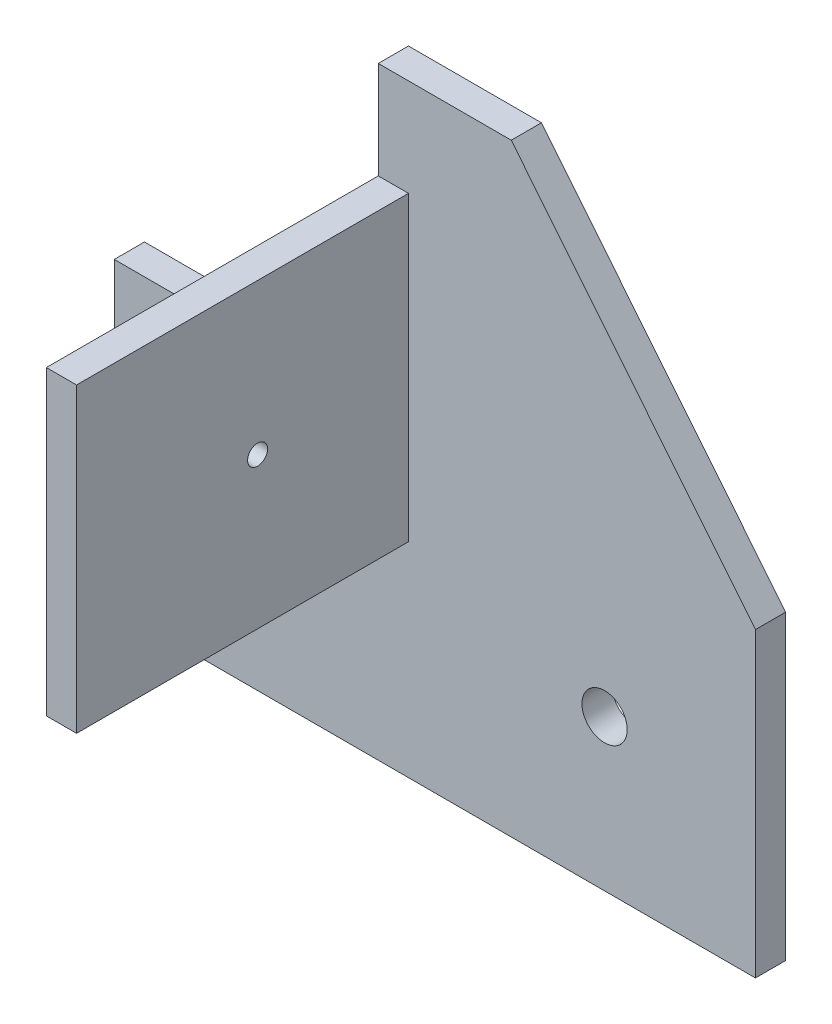
ISO-10303-21;
HEADER;
FILE_DESCRIPTION(('STEP AP214'),'2;1');
FILE_NAME('part.step','',(''),(''),'','','');
FILE_SCHEMA(('AUTOMOTIVE_DESIGN { 1 0 10303 214 1 1 1 1 }'));
ENDSEC;
DATA;
#1=APPLICATION_CONTEXT('core data for automotive mechanical design processes');
#2=APPLICATION_PROTOCOL_DEFINITION('international standard','automotive_design',2000,#1);
#3=PRODUCT_CONTEXT('',#1,'mechanical');
#4=PRODUCT('Part','Part','',(#3));
#5=PRODUCT_RELATED_PRODUCT_CATEGORY('part','',(#4));
#6=PRODUCT_DEFINITION_FORMATION('','',#4);
#7=PRODUCT_DEFINITION_CONTEXT('part definition',#1,'design');
#8=PRODUCT_DEFINITION('design','',#6,#7);
#9=PRODUCT_DEFINITION_SHAPE('','',#8);
#10=(LENGTH_UNIT() NAMED_UNIT(*) SI_UNIT(.MILLI.,.METRE.));
#11=(NAMED_UNIT(*) PLANE_ANGLE_UNIT() SI_UNIT($,.RADIAN.));
#12=(NAMED_UNIT(*) SI_UNIT($,.STERADIAN.) SOLID_ANGLE_UNIT());
#13=UNCERTAINTY_MEASURE_WITH_UNIT(LENGTH_MEASURE(1.E-05),#10,'distance_accuracy_value','');
#14=(GEOMETRIC_REPRESENTATION_CONTEXT(3) GLOBAL_UNCERTAINTY_ASSIGNED_CONTEXT((#13)) GLOBAL_UNIT_ASSIGNED_CONTEXT((#10,
#11,#12)) REPRESENTATION_CONTEXT('',''));
#15=CARTESIAN_POINT('',(0.,0.,0.));
#16=DIRECTION('',(0.,0.,1.));
#17=DIRECTION('',(1.,0.,0.));
#18=AXIS2_PLACEMENT_3D('',#15,#16,#17);
#19=CARTESIAN_POINT('',(0.,0.,4.));
#20=DIRECTION('',(0.,0.,-1.));
#21=DIRECTION('',(-1.,0.,0.));
#22=AXIS2_PLACEMENT_3D('',#19,#20,#21);
#23=PLANE('',#22);
#24=DIRECTION('',(0.,-1.,0.));
#25=VECTOR('',#24,1.);
#26=CARTESIAN_POINT('',(-43.1322957198443,0.,4.));
#27=LINE('',#26,#25);
#28=CARTESIAN_POINT('',(-43.1322957198443,40.,4.));
#29=VERTEX_POINT('',#28);
#30=CARTESIAN_POINT('',(-43.1322957198443,27.0855842893383,4.));
#31=VERTEX_POINT('',#30);
#32=EDGE_CURVE('E175',#29,#31,#27,.T.);
#33=ORIENTED_EDGE('',*,*,#32,.T.);
#34=DIRECTION('',(1.,0.,0.));
#35=VECTOR('',#34,1.);
#36=CARTESIAN_POINT('',(0.,27.0855842893383,4.));
#37=LINE('',#36,#35);
#38=CARTESIAN_POINT('',(-39.1322957198443,27.0855842893383,4.));
#39=VERTEX_POINT('',#38);
#40=EDGE_CURVE('E50',#31,#39,#37,.T.);
#41=ORIENTED_EDGE('',*,*,#40,.T.);
#42=DIRECTION('',(0.,1.,0.));
#43=VECTOR('',#42,1.);
#44=CARTESIAN_POINT('',(-39.1322957198443,0.,4.));
#45=LINE('',#44,#43);
#46=CARTESIAN_POINT('',(-39.1322957198443,-12.9144157106617,4.));
#47=VERTEX_POINT('',#46);
#48=EDGE_CURVE('E54',#47,#39,#45,.T.);
#49=ORIENTED_EDGE('',*,*,#48,.F.);
#50=DIRECTION('',(-1.,0.,0.));
#51=VECTOR('',#50,1.);
#52=CARTESIAN_POINT('',(0.,-12.9144157106617,4.));
#53=LINE('',#52,#51);
#54=CARTESIAN_POINT('',(-43.1322957198443,-12.9144157106617,4.));
#55=VERTEX_POINT('',#54);
#56=EDGE_CURVE('E122',#47,#55,#53,.T.);
#57=ORIENTED_EDGE('',*,*,#56,.T.);
#58=DIRECTION('',(0.,1.,0.));
#59=VECTOR('',#58,1.);
#60=CARTESIAN_POINT('',(-43.1322957198443,0.,4.));
#61=LINE('',#60,#59);
#62=CARTESIAN_POINT('',(-43.1322957198443,0.,4.));
#63=VERTEX_POINT('',#62);
#64=EDGE_CURVE('E149',#55,#63,#61,.T.);
#65=ORIENTED_EDGE('',*,*,#64,.T.);
#66=DIRECTION('',(-1.,0.,0.));
#67=VECTOR('',#66,1.);
#68=CARTESIAN_POINT('',(-78.1322957198443,0.,4.));
#69=LINE('',#68,#67);
#70=CARTESIAN_POINT('',(-78.1322957198443,0.,4.));
#71=VERTEX_POINT('',#70);
#72=EDGE_CURVE('E177',#63,#71,#69,.T.);
#73=ORIENTED_EDGE('',*,*,#72,.T.);
#74=DIRECTION('',(0.,-1.,0.));
#75=VECTOR('',#74,1.);
#76=CARTESIAN_POINT('',(-78.1322957198443,-40.,4.));
#77=LINE('',#76,#75);
#78=CARTESIAN_POINT('',(-78.1322957198443,-40.,4.));
#79=VERTEX_POINT('',#78);
#80=EDGE_CURVE('E163',#71,#79,#77,.T.);
#81=ORIENTED_EDGE('',*,*,#80,.T.);
#82=DIRECTION('',(1.,0.,0.));
#83=VECTOR('',#82,1.);
#84=CARTESIAN_POINT('',(6.86770428015567,-40.,4.));
#85=LINE('',#84,#83);
#86=CARTESIAN_POINT('',(6.86770428015567,-40.,4.));
#87=VERTEX_POINT('',#86);
#88=EDGE_CURVE('E166',#79,#87,#85,.T.);
#89=ORIENTED_EDGE('',*,*,#88,.T.);
#90=DIRECTION('',(0.,1.,0.));
#91=VECTOR('',#90,1.);
#92=CARTESIAN_POINT('',(6.86770428015566,0.,4.));
#93=LINE('',#92,#91);
#94=CARTESIAN_POINT('',(6.86770428015566,0.,4.));
#95=VERTEX_POINT('',#94);
#96=EDGE_CURVE('E169',#87,#95,#93,.T.);
#97=ORIENTED_EDGE('',*,*,#96,.T.);
#98=DIRECTION('',(-0.629111216456673,0.777315301102716,0.));
#99=VECTOR('',#98,1.);
#100=CARTESIAN_POINT('',(-25.5058365758755,40.,4.));
#101=LINE('',#100,#99);
#102=CARTESIAN_POINT('',(-25.5058365758755,40.,4.));
#103=VERTEX_POINT('',#102);
#104=EDGE_CURVE('E171',#95,#103,#101,.T.);
#105=ORIENTED_EDGE('',*,*,#104,.T.);
#106=DIRECTION('',(-1.,0.,0.));
#107=VECTOR('',#106,1.);
#108=CARTESIAN_POINT('',(-43.1322957198443,40.,4.));
#109=LINE('',#108,#107);
#110=EDGE_CURVE('E173',#103,#29,#109,.T.);
#111=ORIENTED_EDGE('',*,*,#110,.T.);
#112=EDGE_LOOP('',(#33,#41,#49,#57,#65,#73,#81,#89,#97,#105,#111));
#113=FACE_BOUND('',#112,.T.);
#114=CARTESIAN_POINT('',(-13.1322957198443,-20.,4.));
#115=DIRECTION('',(0.,0.,1.));
#116=DIRECTION('',(1.,0.,0.));
#117=AXIS2_PLACEMENT_3D('',#114,#115,#116);
#118=CIRCLE('',#117,3.);
#119=CARTESIAN_POINT('',(-10.1322957198443,-20.,4.));
#120=VERTEX_POINT('',#119);
#121=EDGE_CURVE('E157',#120,#120,#118,.T.);
#122=ORIENTED_EDGE('',*,*,#121,.F.);
#123=EDGE_LOOP('',(#122));
#124=FACE_BOUND('',#123,.T.);
#125=ADVANCED_FACE('F35',(#113,#124),#23,.F.);
#126=CARTESIAN_POINT('',(0.,0.,0.));
#127=DIRECTION('',(0.,0.,-1.));
#128=DIRECTION('',(-1.,0.,0.));
#129=AXIS2_PLACEMENT_3D('',#126,#127,#128);
#130=PLANE('',#129);
#131=DIRECTION('',(-1.,0.,0.));
#132=VECTOR('',#131,1.);
#133=CARTESIAN_POINT('',(-78.1322957198443,0.,0.));
#134=LINE('',#133,#132);
#135=CARTESIAN_POINT('',(-43.1322957198443,0.,0.));
#136=VERTEX_POINT('',#135);
#137=CARTESIAN_POINT('',(-78.1322957198443,0.,0.));
#138=VERTEX_POINT('',#137);
#139=EDGE_CURVE('E167',#136,#138,#134,.T.);
#140=ORIENTED_EDGE('',*,*,#139,.F.);
#141=DIRECTION('',(0.,-1.,0.));
#142=VECTOR('',#141,1.);
#143=CARTESIAN_POINT('',(-43.1322957198443,0.,0.));
#144=LINE('',#143,#142);
#145=CARTESIAN_POINT('',(-43.1322957198443,40.,0.));
#146=VERTEX_POINT('',#145);
#147=EDGE_CURVE('E190',#146,#136,#144,.T.);
#148=ORIENTED_EDGE('',*,*,#147,.F.);
#149=DIRECTION('',(-1.,0.,0.));
#150=VECTOR('',#149,1.);
#151=CARTESIAN_POINT('',(-43.1322957198443,40.,0.));
#152=LINE('',#151,#150);
#153=CARTESIAN_POINT('',(-25.5058365758755,40.,0.));
#154=VERTEX_POINT('',#153);
#155=EDGE_CURVE('E188',#154,#146,#152,.T.);
#156=ORIENTED_EDGE('',*,*,#155,.F.);
#157=DIRECTION('',(-0.629111216456673,0.777315301102716,0.));
#158=VECTOR('',#157,1.);
#159=CARTESIAN_POINT('',(-25.5058365758755,40.,0.));
#160=LINE('',#159,#158);
#161=CARTESIAN_POINT('',(6.86770428015566,0.,0.));
#162=VERTEX_POINT('',#161);
#163=EDGE_CURVE('E186',#162,#154,#160,.T.);
#164=ORIENTED_EDGE('',*,*,#163,.F.);
#165=DIRECTION('',(0.,1.,0.));
#166=VECTOR('',#165,1.);
#167=CARTESIAN_POINT('',(6.86770428015566,0.,0.));
#168=LINE('',#167,#166);
#169=CARTESIAN_POINT('',(6.86770428015567,-40.,0.));
#170=VERTEX_POINT('',#169);
#171=EDGE_CURVE('E184',#170,#162,#168,.T.);
#172=ORIENTED_EDGE('',*,*,#171,.F.);
#173=DIRECTION('',(1.,0.,0.));
#174=VECTOR('',#173,1.);
#175=CARTESIAN_POINT('',(6.86770428015567,-40.,0.));
#176=LINE('',#175,#174);
#177=CARTESIAN_POINT('',(-78.1322957198443,-40.,0.));
#178=VERTEX_POINT('',#177);
#179=EDGE_CURVE('E182',#178,#170,#176,.T.);
#180=ORIENTED_EDGE('',*,*,#179,.F.);
#181=DIRECTION('',(0.,-1.,0.));
#182=VECTOR('',#181,1.);
#183=CARTESIAN_POINT('',(-78.1322957198443,-40.,0.));
#184=LINE('',#183,#182);
#185=EDGE_CURVE('E160',#138,#178,#184,.T.);
#186=ORIENTED_EDGE('',*,*,#185,.F.);
#187=EDGE_LOOP('',(#140,#148,#156,#164,#172,#180,#186));
#188=FACE_BOUND('',#187,.T.);
#189=CARTESIAN_POINT('',(-13.1322957198443,-20.,0.));
#190=DIRECTION('',(0.,0.,1.));
#191=DIRECTION('',(1.,0.,0.));
#192=AXIS2_PLACEMENT_3D('',#189,#190,#191);
#193=CIRCLE('',#192,3.);
#194=CARTESIAN_POINT('',(-10.1322957198443,-20.,0.));
#195=VERTEX_POINT('',#194);
#196=EDGE_CURVE('E156',#195,#195,#193,.T.);
#197=ORIENTED_EDGE('',*,*,#196,.T.);
#198=EDGE_LOOP('',(#197));
#199=FACE_BOUND('',#198,.T.);
#200=ADVANCED_FACE('F217',(#188,#199),#130,.T.);
#201=CARTESIAN_POINT('',(-78.1322957198443,-40.,4.));
#202=DIRECTION('',(1.,0.,0.));
#203=DIRECTION('',(0.,0.,-1.));
#204=AXIS2_PLACEMENT_3D('',#201,#202,#203);
#205=PLANE('',#204);
#206=ORIENTED_EDGE('',*,*,#185,.T.);
#207=DIRECTION('',(0.,0.,-1.));
#208=VECTOR('',#207,1.);
#209=CARTESIAN_POINT('',(-78.1322957198443,-40.,4.));
#210=LINE('',#209,#208);
#211=EDGE_CURVE('E11',#79,#178,#210,.T.);
#212=ORIENTED_EDGE('',*,*,#211,.F.);
#213=ORIENTED_EDGE('',*,*,#80,.F.);
#214=DIRECTION('',(0.,0.,-1.));
#215=VECTOR('',#214,1.);
#216=CARTESIAN_POINT('',(-78.1322957198443,0.,4.));
#217=LINE('',#216,#215);
#218=EDGE_CURVE('E179',#71,#138,#217,.T.);
#219=ORIENTED_EDGE('',*,*,#218,.T.);
#220=EDGE_LOOP('',(#206,#212,#213,#219));
#221=FACE_BOUND('',#220,.T.);
#222=ADVANCED_FACE('F37',(#221),#205,.F.);
#223=CARTESIAN_POINT('',(6.86770428015567,-40.,4.));
#224=DIRECTION('',(0.,1.,0.));
#225=DIRECTION('',(-1.,0.,0.));
#226=AXIS2_PLACEMENT_3D('',#223,#224,#225);
#227=PLANE('',#226);
#228=ORIENTED_EDGE('',*,*,#179,.T.);
#229=DIRECTION('',(0.,0.,-1.));
#230=VECTOR('',#229,1.);
#231=CARTESIAN_POINT('',(6.86770428015567,-40.,4.));
#232=LINE('',#231,#230);
#233=EDGE_CURVE('E43',#87,#170,#232,.T.);
#234=ORIENTED_EDGE('',*,*,#233,.F.);
#235=ORIENTED_EDGE('',*,*,#88,.F.);
#236=ORIENTED_EDGE('',*,*,#211,.T.);
#237=EDGE_LOOP('',(#228,#234,#235,#236));
#238=FACE_BOUND('',#237,.T.);
#239=ADVANCED_FACE('F234',(#238),#227,.F.);
#240=CARTESIAN_POINT('',(6.86770428015566,0.,4.));
#241=DIRECTION('',(-1.,0.,0.));
#242=DIRECTION('',(0.,-1.,0.));
#243=AXIS2_PLACEMENT_3D('',#240,#241,#242);
#244=PLANE('',#243);
#245=ORIENTED_EDGE('',*,*,#171,.T.);
#246=DIRECTION('',(0.,0.,-1.));
#247=VECTOR('',#246,1.);
#248=CARTESIAN_POINT('',(6.86770428015566,0.,4.));
#249=LINE('',#248,#247);
#250=EDGE_CURVE('E204',#95,#162,#249,.T.);
#251=ORIENTED_EDGE('',*,*,#250,.F.);
#252=ORIENTED_EDGE('',*,*,#96,.F.);
#253=ORIENTED_EDGE('',*,*,#233,.T.);
#254=EDGE_LOOP('',(#245,#251,#252,#253));
#255=FACE_BOUND('',#254,.T.);
#256=ADVANCED_FACE('F211',(#255),#244,.F.);
#257=CARTESIAN_POINT('',(-25.5058365758755,40.,4.));
#258=DIRECTION('',(-0.777315301102716,-0.629111216456673,0.));
#259=DIRECTION('',(0.629111216456673,-0.777315301102716,0.));
#260=AXIS2_PLACEMENT_3D('',#257,#258,#259);
#261=PLANE('',#260);
#262=ORIENTED_EDGE('',*,*,#163,.T.);
#263=DIRECTION('',(0.,0.,-1.));
#264=VECTOR('',#263,1.);
#265=CARTESIAN_POINT('',(-25.5058365758755,40.,4.));
#266=LINE('',#265,#264);
#267=EDGE_CURVE('E201',#103,#154,#266,.T.);
#268=ORIENTED_EDGE('',*,*,#267,.F.);
#269=ORIENTED_EDGE('',*,*,#104,.F.);
#270=ORIENTED_EDGE('',*,*,#250,.T.);
#271=EDGE_LOOP('',(#262,#268,#269,#270));
#272=FACE_BOUND('',#271,.T.);
#273=ADVANCED_FACE('F224',(#272),#261,.F.);
#274=CARTESIAN_POINT('',(-43.1322957198443,40.,4.));
#275=DIRECTION('',(0.,-1.,0.));
#276=DIRECTION('',(0.,0.,-1.));
#277=AXIS2_PLACEMENT_3D('',#274,#275,#276);
#278=PLANE('',#277);
#279=ORIENTED_EDGE('',*,*,#155,.T.);
#280=DIRECTION('',(0.,0.,-1.));
#281=VECTOR('',#280,1.);
#282=CARTESIAN_POINT('',(-43.1322957198443,40.,4.));
#283=LINE('',#282,#281);
#284=EDGE_CURVE('E198',#29,#146,#283,.T.);
#285=ORIENTED_EDGE('',*,*,#284,.F.);
#286=ORIENTED_EDGE('',*,*,#110,.F.);
#287=ORIENTED_EDGE('',*,*,#267,.T.);
#288=EDGE_LOOP('',(#279,#285,#286,#287));
#289=FACE_BOUND('',#288,.T.);
#290=ADVANCED_FACE('F228',(#289),#278,.F.);
#291=CARTESIAN_POINT('',(-43.1322957198443,0.,4.));
#292=DIRECTION('',(1.,0.,0.));
#293=DIRECTION('',(0.,0.,-1.));
#294=AXIS2_PLACEMENT_3D('',#291,#292,#293);
#295=PLANE('',#294);
#296=ORIENTED_EDGE('',*,*,#147,.T.);
#297=DIRECTION('',(0.,0.,-1.));
#298=VECTOR('',#297,1.);
#299=CARTESIAN_POINT('',(-43.1322957198443,0.,4.));
#300=LINE('',#299,#298);
#301=EDGE_CURVE('E195',#63,#136,#300,.T.);
#302=ORIENTED_EDGE('',*,*,#301,.F.);
#303=ORIENTED_EDGE('',*,*,#64,.F.);
#304=DIRECTION('',(0.,0.,1.));
#305=VECTOR('',#304,1.);
#306=CARTESIAN_POINT('',(-43.1322957198443,-12.9144157106617,48.));
#307=LINE('',#306,#305);
#308=CARTESIAN_POINT('',(-43.1322957198443,-12.9144157106617,48.));
#309=VERTEX_POINT('',#308);
#310=EDGE_CURVE('E143',#55,#309,#307,.T.);
#311=ORIENTED_EDGE('',*,*,#310,.T.);
#312=DIRECTION('',(0.,1.,0.));
#313=VECTOR('',#312,1.);
#314=CARTESIAN_POINT('',(-43.1322957198443,-12.9144157106617,48.));
#315=LINE('',#314,#313);
#316=CARTESIAN_POINT('',(-43.1322957198443,27.0855842893383,48.));
#317=VERTEX_POINT('',#316);
#318=EDGE_CURVE('E133',#309,#317,#315,.T.);
#319=ORIENTED_EDGE('',*,*,#318,.T.);
#320=DIRECTION('',(0.,0.,-1.));
#321=VECTOR('',#320,1.);
#322=CARTESIAN_POINT('',(-43.1322957198443,27.0855842893383,48.));
#323=LINE('',#322,#321);
#324=EDGE_CURVE('E126',#317,#31,#323,.T.);
#325=ORIENTED_EDGE('',*,*,#324,.T.);
#326=ORIENTED_EDGE('',*,*,#32,.F.);
#327=ORIENTED_EDGE('',*,*,#284,.T.);
#328=EDGE_LOOP('',(#296,#302,#303,#311,#319,#325,#326,#327));
#329=FACE_BOUND('',#328,.T.);
#330=CARTESIAN_POINT('',(-43.1322957198443,7.08558428933828,24.));
#331=DIRECTION('',(-1.,0.,0.));
#332=DIRECTION('',(0.,0.,1.));
#333=AXIS2_PLACEMENT_3D('',#330,#331,#332);
#334=CIRCLE('',#333,1.32494106783463);
#335=CARTESIAN_POINT('',(-43.1322957198443,7.08558428933828,25.3249410678346));
#336=VERTEX_POINT('',#335);
#337=EDGE_CURVE('E341',#336,#336,#334,.T.);
#338=ORIENTED_EDGE('',*,*,#337,.F.);
#339=EDGE_LOOP('',(#338));
#340=FACE_BOUND('',#339,.T.);
#341=ADVANCED_FACE('F242',(#329,#340),#295,.F.);
#342=CARTESIAN_POINT('',(-78.1322957198443,0.,4.));
#343=DIRECTION('',(0.,-1.,0.));
#344=DIRECTION('',(0.,0.,-1.));
#345=AXIS2_PLACEMENT_3D('',#342,#343,#344);
#346=PLANE('',#345);
#347=ORIENTED_EDGE('',*,*,#139,.T.);
#348=ORIENTED_EDGE('',*,*,#218,.F.);
#349=ORIENTED_EDGE('',*,*,#72,.F.);
#350=ORIENTED_EDGE('',*,*,#301,.T.);
#351=EDGE_LOOP('',(#347,#348,#349,#350));
#352=FACE_BOUND('',#351,.T.);
#353=ADVANCED_FACE('F238',(#352),#346,.F.);
#354=CARTESIAN_POINT('',(-13.1322957198443,-20.,4.));
#355=DIRECTION('',(0.,0.,-1.));
#356=DIRECTION('',(-1.,0.,0.));
#357=AXIS2_PLACEMENT_3D('',#354,#355,#356);
#358=CYLINDRICAL_SURFACE('',#357,3.);
#359=ORIENTED_EDGE('',*,*,#121,.T.);
#360=EDGE_LOOP('',(#359));
#361=FACE_BOUND('',#360,.T.);
#362=ORIENTED_EDGE('',*,*,#196,.F.);
#363=EDGE_LOOP('',(#362));
#364=FACE_BOUND('',#363,.T.);
#365=ADVANCED_FACE('F265',(#361,#364),#358,.F.);
#366=CARTESIAN_POINT('',(-39.1322957198443,-12.9144157106617,48.));
#367=DIRECTION('',(0.,-1.,0.));
#368=DIRECTION('',(0.,0.,-1.));
#369=AXIS2_PLACEMENT_3D('',#366,#367,#368);
#370=PLANE('',#369);
#371=ORIENTED_EDGE('',*,*,#56,.F.);
#372=DIRECTION('',(0.,0.,1.));
#373=VECTOR('',#372,1.);
#374=CARTESIAN_POINT('',(-39.1322957198443,-12.9144157106617,48.));
#375=LINE('',#374,#373);
#376=CARTESIAN_POINT('',(-39.1322957198443,-12.9144157106617,48.));
#377=VERTEX_POINT('',#376);
#378=EDGE_CURVE('E116',#47,#377,#375,.T.);
#379=ORIENTED_EDGE('',*,*,#378,.T.);
#380=DIRECTION('',(-1.,0.,0.));
#381=VECTOR('',#380,1.);
#382=CARTESIAN_POINT('',(-39.1322957198443,-12.9144157106617,48.));
#383=LINE('',#382,#381);
#384=EDGE_CURVE('E120',#377,#309,#383,.T.);
#385=ORIENTED_EDGE('',*,*,#384,.T.);
#386=ORIENTED_EDGE('',*,*,#310,.F.);
#387=EDGE_LOOP('',(#371,#379,#385,#386));
#388=FACE_BOUND('',#387,.T.);
#389=ADVANCED_FACE('F118',(#388),#370,.T.);
#390=CARTESIAN_POINT('',(-39.1322957198443,0.,0.));
#391=DIRECTION('',(-1.,0.,0.));
#392=DIRECTION('',(0.,0.,1.));
#393=AXIS2_PLACEMENT_3D('',#390,#391,#392);
#394=PLANE('',#393);
#395=CARTESIAN_POINT('',(-39.1322957198443,7.08558428933828,24.));
#396=DIRECTION('',(-1.,0.,0.));
#397=DIRECTION('',(0.,0.,1.));
#398=AXIS2_PLACEMENT_3D('',#395,#396,#397);
#399=CIRCLE('',#398,1.32494106783463);
#400=CARTESIAN_POINT('',(-39.1322957198443,7.08558428933828,25.3249410678346));
#401=VERTEX_POINT('',#400);
#402=EDGE_CURVE('E145',#401,#401,#399,.T.);
#403=ORIENTED_EDGE('',*,*,#402,.T.);
#404=EDGE_LOOP('',(#403));
#405=FACE_BOUND('',#404,.T.);
#406=ORIENTED_EDGE('',*,*,#378,.F.);
#407=ORIENTED_EDGE('',*,*,#48,.T.);
#408=DIRECTION('',(0.,0.,-1.));
#409=VECTOR('',#408,1.);
#410=CARTESIAN_POINT('',(-39.1322957198443,27.0855842893383,48.));
#411=LINE('',#410,#409);
#412=CARTESIAN_POINT('',(-39.1322957198443,27.0855842893383,48.));
#413=VERTEX_POINT('',#412);
#414=EDGE_CURVE('E135',#413,#39,#411,.T.);
#415=ORIENTED_EDGE('',*,*,#414,.F.);
#416=DIRECTION('',(0.,1.,0.));
#417=VECTOR('',#416,1.);
#418=CARTESIAN_POINT('',(-39.1322957198443,-12.9144157106617,48.));
#419=LINE('',#418,#417);
#420=EDGE_CURVE('E125',#377,#413,#419,.T.);
#421=ORIENTED_EDGE('',*,*,#420,.F.);
#422=EDGE_LOOP('',(#406,#407,#415,#421));
#423=FACE_BOUND('',#422,.T.);
#424=ADVANCED_FACE('F137',(#405,#423),#394,.F.);
#425=CARTESIAN_POINT('',(-39.1322957198443,27.0855842893383,48.));
#426=DIRECTION('',(0.,1.,0.));
#427=DIRECTION('',(0.,0.,1.));
#428=AXIS2_PLACEMENT_3D('',#425,#426,#427);
#429=PLANE('',#428);
#430=ORIENTED_EDGE('',*,*,#40,.F.);
#431=ORIENTED_EDGE('',*,*,#324,.F.);
#432=DIRECTION('',(-1.,0.,0.));
#433=VECTOR('',#432,1.);
#434=CARTESIAN_POINT('',(-39.1322957198443,27.0855842893383,48.));
#435=LINE('',#434,#433);
#436=EDGE_CURVE('E134',#413,#317,#435,.T.);
#437=ORIENTED_EDGE('',*,*,#436,.F.);
#438=ORIENTED_EDGE('',*,*,#414,.T.);
#439=EDGE_LOOP('',(#430,#431,#437,#438));
#440=FACE_BOUND('',#439,.T.);
#441=ADVANCED_FACE('F246',(#440),#429,.T.);
#442=CARTESIAN_POINT('',(-39.1322957198443,-12.9144157106617,48.));
#443=DIRECTION('',(0.,0.,1.));
#444=DIRECTION('',(1.,0.,0.));
#445=AXIS2_PLACEMENT_3D('',#442,#443,#444);
#446=PLANE('',#445);
#447=ORIENTED_EDGE('',*,*,#318,.F.);
#448=ORIENTED_EDGE('',*,*,#384,.F.);
#449=ORIENTED_EDGE('',*,*,#420,.T.);
#450=ORIENTED_EDGE('',*,*,#436,.T.);
#451=EDGE_LOOP('',(#447,#448,#449,#450));
#452=FACE_BOUND('',#451,.T.);
#453=ADVANCED_FACE('F130',(#452),#446,.T.);
#454=CARTESIAN_POINT('',(-39.1322957198443,7.08558428933828,24.));
#455=DIRECTION('',(-1.,0.,0.));
#456=DIRECTION('',(0.,0.,1.));
#457=AXIS2_PLACEMENT_3D('',#454,#455,#456);
#458=CYLINDRICAL_SURFACE('',#457,1.32494106783463);
#459=ORIENTED_EDGE('',*,*,#402,.F.);
#460=EDGE_LOOP('',(#459));
#461=FACE_BOUND('',#460,.T.);
#462=ORIENTED_EDGE('',*,*,#337,.T.);
#463=EDGE_LOOP('',(#462));
#464=FACE_BOUND('',#463,.T.);
#465=ADVANCED_FACE('F253',(#461,#464),#458,.F.);
#466=CLOSED_SHELL('',(#125,#200,#222,#239,#256,#273,#290,#341,#353,#365,#389,#424,#441,#453,#465));
#467=MANIFOLD_SOLID_BREP('B2',#466);
#468=ADVANCED_BREP_SHAPE_REPRESENTATION('',(#18,#467),#14);
#469=SHAPE_DEFINITION_REPRESENTATION(#9,#468);
ENDSEC;
END-ISO-10303-21;
